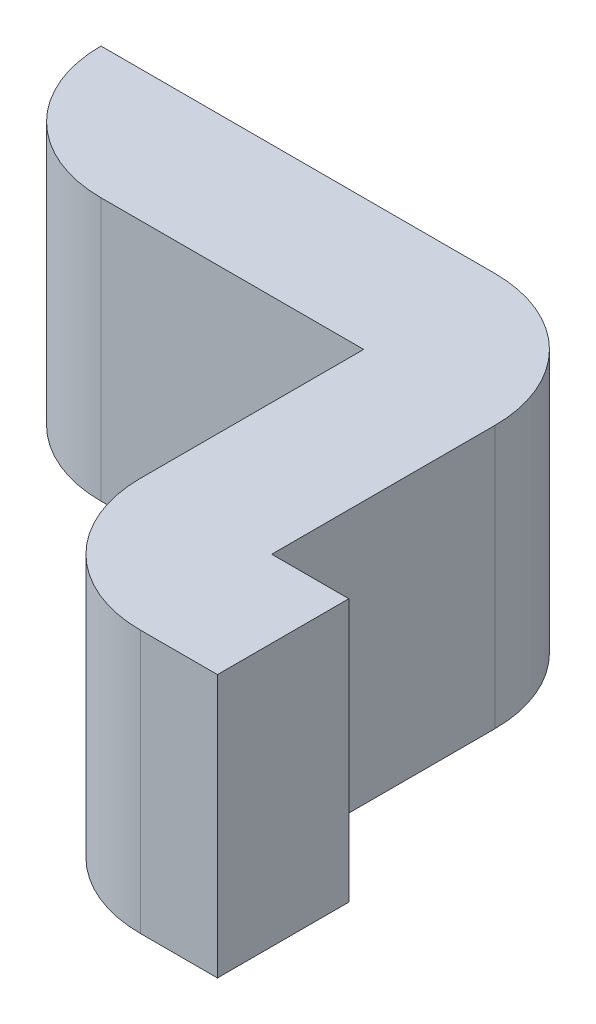
ISO-10303-21;
HEADER;
FILE_DESCRIPTION(('STEP AP214'),'2;1');
FILE_NAME('part.step','',(''),(''),'','','');
FILE_SCHEMA(('AUTOMOTIVE_DESIGN { 1 0 10303 214 1 1 1 1 }'));
ENDSEC;
DATA;
#1=APPLICATION_CONTEXT('core data for automotive mechanical design processes');
#2=APPLICATION_PROTOCOL_DEFINITION('international standard','automotive_design',2000,#1);
#3=PRODUCT_CONTEXT('',#1,'mechanical');
#4=PRODUCT('Part','Part','',(#3));
#5=PRODUCT_RELATED_PRODUCT_CATEGORY('part','',(#4));
#6=PRODUCT_DEFINITION_FORMATION('','',#4);
#7=PRODUCT_DEFINITION_CONTEXT('part definition',#1,'design');
#8=PRODUCT_DEFINITION('design','',#6,#7);
#9=PRODUCT_DEFINITION_SHAPE('','',#8);
#10=(LENGTH_UNIT() NAMED_UNIT(*) SI_UNIT(.MILLI.,.METRE.));
#11=(NAMED_UNIT(*) PLANE_ANGLE_UNIT() SI_UNIT($,.RADIAN.));
#12=(NAMED_UNIT(*) SI_UNIT($,.STERADIAN.) SOLID_ANGLE_UNIT());
#13=UNCERTAINTY_MEASURE_WITH_UNIT(LENGTH_MEASURE(1.E-05),#10,'distance_accuracy_value','');
#14=(GEOMETRIC_REPRESENTATION_CONTEXT(3) GLOBAL_UNCERTAINTY_ASSIGNED_CONTEXT((#13)) GLOBAL_UNIT_ASSIGNED_CONTEXT((#10,
#11,#12)) REPRESENTATION_CONTEXT('',''));
#15=CARTESIAN_POINT('',(0.,0.,0.));
#16=DIRECTION('',(0.,0.,1.));
#17=DIRECTION('',(1.,0.,0.));
#18=AXIS2_PLACEMENT_3D('',#15,#16,#17);
#19=CARTESIAN_POINT('',(-1.0287,1.2954,0.));
#20=DIRECTION('',(0.,-1.,0.));
#21=DIRECTION('',(0.,0.,-1.));
#22=AXIS2_PLACEMENT_3D('',#19,#20,#21);
#23=PLANE('',#22);
#24=DIRECTION('',(-1.,0.,0.));
#25=VECTOR('',#24,1.);
#26=CARTESIAN_POINT('',(-0.9017,1.2954,0.127));
#27=LINE('',#26,#25);
#28=CARTESIAN_POINT('',(-0.9017,1.2954,0.127));
#29=VERTEX_POINT('',#28);
#30=CARTESIAN_POINT('',(-0.6477,1.2954,0.127));
#31=VERTEX_POINT('',#30);
#32=EDGE_CURVE('E102',#29,#31,#27,.F.);
#33=ORIENTED_EDGE('',*,*,#32,.T.);
#34=DIRECTION('',(0.,0.,-1.));
#35=VECTOR('',#34,1.);
#36=CARTESIAN_POINT('',(-0.6477,1.2954,0.127));
#37=LINE('',#36,#35);
#38=CARTESIAN_POINT('',(-0.6477,1.2954,0.3429));
#39=VERTEX_POINT('',#38);
#40=EDGE_CURVE('E105',#31,#39,#37,.F.);
#41=ORIENTED_EDGE('',*,*,#40,.T.);
#42=CARTESIAN_POINT('',(-0.5207,1.2954,0.3429));
#43=DIRECTION('',(0.,-1.,0.));
#44=DIRECTION('',(0.,0.,-1.));
#45=AXIS2_PLACEMENT_3D('',#42,#43,#44);
#46=CIRCLE('',#45,0.127);
#47=CARTESIAN_POINT('',(-0.5207,1.2954,0.4699));
#48=VERTEX_POINT('',#47);
#49=EDGE_CURVE('E117',#48,#39,#46,.T.);
#50=ORIENTED_EDGE('',*,*,#49,.F.);
#51=DIRECTION('',(-1.,0.,0.));
#52=VECTOR('',#51,1.);
#53=CARTESIAN_POINT('',(-0.5207,1.2954,0.4699));
#54=LINE('',#53,#52);
#55=CARTESIAN_POINT('',(-0.4461588971,1.2954,0.4699));
#56=VERTEX_POINT('',#55);
#57=EDGE_CURVE('E134',#48,#56,#54,.F.);
#58=ORIENTED_EDGE('',*,*,#57,.T.);
#59=DIRECTION('',(0.,0.,1.));
#60=VECTOR('',#59,1.);
#61=CARTESIAN_POINT('',(-0.4461588971,1.2954,0.4699));
#62=LINE('',#61,#60);
#63=CARTESIAN_POINT('',(-0.4461588971,1.2954,0.3429));
#64=VERTEX_POINT('',#63);
#65=EDGE_CURVE('E90',#56,#64,#62,.F.);
#66=ORIENTED_EDGE('',*,*,#65,.T.);
#67=DIRECTION('',(1.,0.,0.));
#68=VECTOR('',#67,1.);
#69=CARTESIAN_POINT('',(-0.4461588971,1.2954,0.3429));
#70=LINE('',#69,#68);
#71=CARTESIAN_POINT('',(-0.5207,1.2954,0.3429));
#72=VERTEX_POINT('',#71);
#73=EDGE_CURVE('E87',#64,#72,#70,.F.);
#74=ORIENTED_EDGE('',*,*,#73,.T.);
#75=DIRECTION('',(0.,0.,1.));
#76=VECTOR('',#75,1.);
#77=CARTESIAN_POINT('',(-0.5207,1.2954,0.3429));
#78=LINE('',#77,#76);
#79=CARTESIAN_POINT('',(-0.5207,1.2954,0.127));
#80=VERTEX_POINT('',#79);
#81=EDGE_CURVE('E82',#72,#80,#78,.F.);
#82=ORIENTED_EDGE('',*,*,#81,.T.);
#83=CARTESIAN_POINT('',(-0.6477,1.2954,0.127));
#84=DIRECTION('',(0.,-1.,0.));
#85=DIRECTION('',(0.,0.,-1.));
#86=AXIS2_PLACEMENT_3D('',#83,#84,#85);
#87=CIRCLE('',#86,0.127);
#88=CARTESIAN_POINT('',(-0.6477,1.2954,0.));
#89=VERTEX_POINT('',#88);
#90=EDGE_CURVE('E20',#89,#80,#87,.T.);
#91=ORIENTED_EDGE('',*,*,#90,.F.);
#92=DIRECTION('',(1.,0.,0.));
#93=VECTOR('',#92,1.);
#94=CARTESIAN_POINT('',(-0.6477,1.2954,0.));
#95=LINE('',#94,#93);
#96=CARTESIAN_POINT('',(-1.0287,1.2954,0.));
#97=VERTEX_POINT('',#96);
#98=EDGE_CURVE('E76',#89,#97,#95,.F.);
#99=ORIENTED_EDGE('',*,*,#98,.T.);
#100=CARTESIAN_POINT('',(-0.9017,1.2954,0.));
#101=DIRECTION('',(0.,-1.,0.));
#102=DIRECTION('',(0.,0.,-1.));
#103=AXIS2_PLACEMENT_3D('',#100,#101,#102);
#104=CIRCLE('',#103,0.127);
#105=EDGE_CURVE('E108',#29,#97,#104,.T.);
#106=ORIENTED_EDGE('',*,*,#105,.F.);
#107=EDGE_LOOP('',(#33,#41,#50,#58,#66,#74,#82,#91,#99,#106));
#108=FACE_BOUND('',#107,.T.);
#109=ADVANCED_FACE('F17',(#108),#23,.F.);
#110=CARTESIAN_POINT('',(-0.6477,1.0414,0.));
#111=DIRECTION('',(0.,0.,1.));
#112=DIRECTION('',(1.,0.,0.));
#113=AXIS2_PLACEMENT_3D('',#110,#111,#112);
#114=PLANE('',#113);
#115=DIRECTION('',(0.,-1.,0.));
#116=VECTOR('',#115,1.);
#117=CARTESIAN_POINT('',(-1.0287,1.0414,0.));
#118=LINE('',#117,#116);
#119=CARTESIAN_POINT('',(-1.0287,1.0414,0.));
#120=VERTEX_POINT('',#119);
#121=EDGE_CURVE('E187',#97,#120,#118,.T.);
#122=ORIENTED_EDGE('',*,*,#121,.F.);
#123=ORIENTED_EDGE('',*,*,#98,.F.);
#124=DIRECTION('',(0.,-1.,0.));
#125=VECTOR('',#124,1.);
#126=CARTESIAN_POINT('',(-0.6477,1.0414,0.));
#127=LINE('',#126,#125);
#128=CARTESIAN_POINT('',(-0.6477,1.0414,0.));
#129=VERTEX_POINT('',#128);
#130=EDGE_CURVE('E159',#129,#89,#127,.F.);
#131=ORIENTED_EDGE('',*,*,#130,.F.);
#132=DIRECTION('',(1.,0.,0.));
#133=VECTOR('',#132,1.);
#134=CARTESIAN_POINT('',(-1.0287,1.0414,0.));
#135=LINE('',#134,#133);
#136=EDGE_CURVE('E186',#120,#129,#135,.T.);
#137=ORIENTED_EDGE('',*,*,#136,.F.);
#138=EDGE_LOOP('',(#122,#123,#131,#137));
#139=FACE_BOUND('',#138,.T.);
#140=ADVANCED_FACE('F217',(#139),#114,.F.);
#141=CARTESIAN_POINT('',(-0.6477,1.0414,0.127));
#142=DIRECTION('',(0.,-1.,0.));
#143=DIRECTION('',(0.,0.,-1.));
#144=AXIS2_PLACEMENT_3D('',#141,#142,#143);
#145=CYLINDRICAL_SURFACE('',#144,0.127);
#146=ORIENTED_EDGE('',*,*,#90,.T.);
#147=DIRECTION('',(0.,1.,0.));
#148=VECTOR('',#147,1.);
#149=CARTESIAN_POINT('',(-0.5207,1.0414,0.127));
#150=LINE('',#149,#148);
#151=CARTESIAN_POINT('',(-0.5207,1.0414,0.127));
#152=VERTEX_POINT('',#151);
#153=EDGE_CURVE('E157',#80,#152,#150,.F.);
#154=ORIENTED_EDGE('',*,*,#153,.T.);
#155=CARTESIAN_POINT('',(-0.6477,1.0414,0.127));
#156=DIRECTION('',(0.,-1.,0.));
#157=DIRECTION('',(0.,0.,-1.));
#158=AXIS2_PLACEMENT_3D('',#155,#156,#157);
#159=CIRCLE('',#158,0.127);
#160=EDGE_CURVE('E183',#129,#152,#159,.T.);
#161=ORIENTED_EDGE('',*,*,#160,.F.);
#162=ORIENTED_EDGE('',*,*,#130,.T.);
#163=EDGE_LOOP('',(#146,#154,#161,#162));
#164=FACE_BOUND('',#163,.T.);
#165=ADVANCED_FACE('F214',(#164),#145,.T.);
#166=CARTESIAN_POINT('',(-0.5207,1.0414,0.3429));
#167=DIRECTION('',(-1.,0.,0.));
#168=DIRECTION('',(0.,0.,1.));
#169=AXIS2_PLACEMENT_3D('',#166,#167,#168);
#170=PLANE('',#169);
#171=ORIENTED_EDGE('',*,*,#153,.F.);
#172=ORIENTED_EDGE('',*,*,#81,.F.);
#173=DIRECTION('',(0.,1.,0.));
#174=VECTOR('',#173,1.);
#175=CARTESIAN_POINT('',(-0.5207,1.0414,0.3429));
#176=LINE('',#175,#174);
#177=CARTESIAN_POINT('',(-0.5207,1.0414,0.3429));
#178=VERTEX_POINT('',#177);
#179=EDGE_CURVE('E153',#72,#178,#176,.F.);
#180=ORIENTED_EDGE('',*,*,#179,.T.);
#181=DIRECTION('',(0.,0.,-1.));
#182=VECTOR('',#181,1.);
#183=CARTESIAN_POINT('',(-0.5207,1.0414,0.));
#184=LINE('',#183,#182);
#185=EDGE_CURVE('E150',#152,#178,#184,.F.);
#186=ORIENTED_EDGE('',*,*,#185,.F.);
#187=EDGE_LOOP('',(#171,#172,#180,#186));
#188=FACE_BOUND('',#187,.T.);
#189=ADVANCED_FACE('F211',(#188),#170,.F.);
#190=CARTESIAN_POINT('',(-0.4461588971,1.0414,0.3429));
#191=DIRECTION('',(0.,0.,1.));
#192=DIRECTION('',(1.,0.,0.));
#193=AXIS2_PLACEMENT_3D('',#190,#191,#192);
#194=PLANE('',#193);
#195=ORIENTED_EDGE('',*,*,#179,.F.);
#196=ORIENTED_EDGE('',*,*,#73,.F.);
#197=DIRECTION('',(0.,1.,0.));
#198=VECTOR('',#197,1.);
#199=CARTESIAN_POINT('',(-0.4461588971,1.0414,0.3429));
#200=LINE('',#199,#198);
#201=CARTESIAN_POINT('',(-0.4461588971,1.0414,0.3429));
#202=VERTEX_POINT('',#201);
#203=EDGE_CURVE('E144',#64,#202,#200,.F.);
#204=ORIENTED_EDGE('',*,*,#203,.T.);
#205=DIRECTION('',(1.,0.,0.));
#206=VECTOR('',#205,1.);
#207=CARTESIAN_POINT('',(-1.0287,1.0414,0.3429));
#208=LINE('',#207,#206);
#209=EDGE_CURVE('E141',#178,#202,#208,.T.);
#210=ORIENTED_EDGE('',*,*,#209,.F.);
#211=EDGE_LOOP('',(#195,#196,#204,#210));
#212=FACE_BOUND('',#211,.T.);
#213=ADVANCED_FACE('F208',(#212),#194,.F.);
#214=CARTESIAN_POINT('',(-0.4461588971,1.0414,0.4699));
#215=DIRECTION('',(-1.,0.,0.));
#216=DIRECTION('',(0.,0.,1.));
#217=AXIS2_PLACEMENT_3D('',#214,#215,#216);
#218=PLANE('',#217);
#219=ORIENTED_EDGE('',*,*,#203,.F.);
#220=ORIENTED_EDGE('',*,*,#65,.F.);
#221=DIRECTION('',(0.,1.,0.));
#222=VECTOR('',#221,1.);
#223=CARTESIAN_POINT('',(-0.4461588971,1.0414,0.4699));
#224=LINE('',#223,#222);
#225=CARTESIAN_POINT('',(-0.4461588971,1.0414,0.4699));
#226=VERTEX_POINT('',#225);
#227=EDGE_CURVE('E132',#56,#226,#224,.F.);
#228=ORIENTED_EDGE('',*,*,#227,.T.);
#229=DIRECTION('',(0.,0.,-1.));
#230=VECTOR('',#229,1.);
#231=CARTESIAN_POINT('',(-0.4461588971,1.0414,0.));
#232=LINE('',#231,#230);
#233=EDGE_CURVE('E137',#202,#226,#232,.F.);
#234=ORIENTED_EDGE('',*,*,#233,.F.);
#235=EDGE_LOOP('',(#219,#220,#228,#234));
#236=FACE_BOUND('',#235,.T.);
#237=ADVANCED_FACE('F195',(#236),#218,.F.);
#238=CARTESIAN_POINT('',(-0.5207,1.0414,0.4699));
#239=DIRECTION('',(0.,0.,-1.));
#240=DIRECTION('',(-1.,0.,0.));
#241=AXIS2_PLACEMENT_3D('',#238,#239,#240);
#242=PLANE('',#241);
#243=ORIENTED_EDGE('',*,*,#227,.F.);
#244=ORIENTED_EDGE('',*,*,#57,.F.);
#245=DIRECTION('',(0.,-1.,0.));
#246=VECTOR('',#245,1.);
#247=CARTESIAN_POINT('',(-0.5207,1.0414,0.4699));
#248=LINE('',#247,#246);
#249=CARTESIAN_POINT('',(-0.5207,1.0414,0.4699));
#250=VERTEX_POINT('',#249);
#251=EDGE_CURVE('E129',#250,#48,#248,.F.);
#252=ORIENTED_EDGE('',*,*,#251,.F.);
#253=DIRECTION('',(1.,0.,0.));
#254=VECTOR('',#253,1.);
#255=CARTESIAN_POINT('',(-1.0287,1.0414,0.4699));
#256=LINE('',#255,#254);
#257=EDGE_CURVE('E140',#226,#250,#256,.F.);
#258=ORIENTED_EDGE('',*,*,#257,.F.);
#259=EDGE_LOOP('',(#243,#244,#252,#258));
#260=FACE_BOUND('',#259,.T.);
#261=ADVANCED_FACE('F198',(#260),#242,.F.);
#262=CARTESIAN_POINT('',(-0.5207,1.0414,0.3429));
#263=DIRECTION('',(0.,-1.,0.));
#264=DIRECTION('',(0.,0.,-1.));
#265=AXIS2_PLACEMENT_3D('',#262,#263,#264);
#266=CYLINDRICAL_SURFACE('',#265,0.127);
#267=ORIENTED_EDGE('',*,*,#49,.T.);
#268=DIRECTION('',(0.,1.,0.));
#269=VECTOR('',#268,1.);
#270=CARTESIAN_POINT('',(-0.6477,1.0414,0.3429));
#271=LINE('',#270,#269);
#272=CARTESIAN_POINT('',(-0.6477,1.0414,0.3429));
#273=VERTEX_POINT('',#272);
#274=EDGE_CURVE('E111',#39,#273,#271,.F.);
#275=ORIENTED_EDGE('',*,*,#274,.T.);
#276=CARTESIAN_POINT('',(-0.5207,1.0414,0.3429));
#277=DIRECTION('',(0.,-1.,0.));
#278=DIRECTION('',(0.,0.,-1.));
#279=AXIS2_PLACEMENT_3D('',#276,#277,#278);
#280=CIRCLE('',#279,0.127);
#281=EDGE_CURVE('E179',#250,#273,#280,.T.);
#282=ORIENTED_EDGE('',*,*,#281,.F.);
#283=ORIENTED_EDGE('',*,*,#251,.T.);
#284=EDGE_LOOP('',(#267,#275,#282,#283));
#285=FACE_BOUND('',#284,.T.);
#286=ADVANCED_FACE('F189',(#285),#266,.T.);
#287=CARTESIAN_POINT('',(-0.6477,1.0414,0.127));
#288=DIRECTION('',(1.,0.,0.));
#289=DIRECTION('',(0.,0.,-1.));
#290=AXIS2_PLACEMENT_3D('',#287,#288,#289);
#291=PLANE('',#290);
#292=ORIENTED_EDGE('',*,*,#274,.F.);
#293=ORIENTED_EDGE('',*,*,#40,.F.);
#294=DIRECTION('',(0.,1.,0.));
#295=VECTOR('',#294,1.);
#296=CARTESIAN_POINT('',(-0.6477,1.0414,0.127));
#297=LINE('',#296,#295);
#298=CARTESIAN_POINT('',(-0.6477,1.0414,0.127));
#299=VERTEX_POINT('',#298);
#300=EDGE_CURVE('E110',#31,#299,#297,.F.);
#301=ORIENTED_EDGE('',*,*,#300,.T.);
#302=DIRECTION('',(0.,0.,-1.));
#303=VECTOR('',#302,1.);
#304=CARTESIAN_POINT('',(-0.6477,1.0414,0.));
#305=LINE('',#304,#303);
#306=EDGE_CURVE('E182',#273,#299,#305,.T.);
#307=ORIENTED_EDGE('',*,*,#306,.F.);
#308=EDGE_LOOP('',(#292,#293,#301,#307));
#309=FACE_BOUND('',#308,.T.);
#310=ADVANCED_FACE('F115',(#309),#291,.F.);
#311=CARTESIAN_POINT('',(-0.9017,1.0414,0.127));
#312=DIRECTION('',(0.,0.,-1.));
#313=DIRECTION('',(-1.,0.,0.));
#314=AXIS2_PLACEMENT_3D('',#311,#312,#313);
#315=PLANE('',#314);
#316=ORIENTED_EDGE('',*,*,#300,.F.);
#317=ORIENTED_EDGE('',*,*,#32,.F.);
#318=DIRECTION('',(0.,-1.,0.));
#319=VECTOR('',#318,1.);
#320=CARTESIAN_POINT('',(-0.9017,1.0414,0.127));
#321=LINE('',#320,#319);
#322=CARTESIAN_POINT('',(-0.9017,1.0414,0.127));
#323=VERTEX_POINT('',#322);
#324=EDGE_CURVE('E35',#323,#29,#321,.F.);
#325=ORIENTED_EDGE('',*,*,#324,.F.);
#326=DIRECTION('',(1.,0.,0.));
#327=VECTOR('',#326,1.);
#328=CARTESIAN_POINT('',(-1.0287,1.0414,0.127));
#329=LINE('',#328,#327);
#330=EDGE_CURVE('E26',#299,#323,#329,.F.);
#331=ORIENTED_EDGE('',*,*,#330,.F.);
#332=EDGE_LOOP('',(#316,#317,#325,#331));
#333=FACE_BOUND('',#332,.T.);
#334=ADVANCED_FACE('F119',(#333),#315,.F.);
#335=CARTESIAN_POINT('',(-0.9017,1.0414,0.));
#336=DIRECTION('',(0.,-1.,0.));
#337=DIRECTION('',(0.,0.,-1.));
#338=AXIS2_PLACEMENT_3D('',#335,#336,#337);
#339=CYLINDRICAL_SURFACE('',#338,0.127);
#340=ORIENTED_EDGE('',*,*,#105,.T.);
#341=ORIENTED_EDGE('',*,*,#121,.T.);
#342=CARTESIAN_POINT('',(-0.9017,1.0414,0.));
#343=DIRECTION('',(0.,-1.,0.));
#344=DIRECTION('',(0.,0.,-1.));
#345=AXIS2_PLACEMENT_3D('',#342,#343,#344);
#346=CIRCLE('',#345,0.127);
#347=EDGE_CURVE('E11',#323,#120,#346,.T.);
#348=ORIENTED_EDGE('',*,*,#347,.F.);
#349=ORIENTED_EDGE('',*,*,#324,.T.);
#350=EDGE_LOOP('',(#340,#341,#348,#349));
#351=FACE_BOUND('',#350,.T.);
#352=ADVANCED_FACE('F219',(#351),#339,.T.);
#353=CARTESIAN_POINT('',(-1.0287,1.0414,0.));
#354=DIRECTION('',(0.,-1.,0.));
#355=DIRECTION('',(0.,0.,-1.));
#356=AXIS2_PLACEMENT_3D('',#353,#354,#355);
#357=PLANE('',#356);
#358=ORIENTED_EDGE('',*,*,#330,.T.);
#359=ORIENTED_EDGE('',*,*,#347,.T.);
#360=ORIENTED_EDGE('',*,*,#136,.T.);
#361=ORIENTED_EDGE('',*,*,#160,.T.);
#362=ORIENTED_EDGE('',*,*,#185,.T.);
#363=ORIENTED_EDGE('',*,*,#209,.T.);
#364=ORIENTED_EDGE('',*,*,#233,.T.);
#365=ORIENTED_EDGE('',*,*,#257,.T.);
#366=ORIENTED_EDGE('',*,*,#281,.T.);
#367=ORIENTED_EDGE('',*,*,#306,.T.);
#368=EDGE_LOOP('',(#358,#359,#360,#361,#362,#363,#364,#365,#366,#367));
#369=FACE_BOUND('',#368,.T.);
#370=ADVANCED_FACE('F202',(#369),#357,.T.);
#371=CLOSED_SHELL('',(#109,#140,#165,#189,#213,#237,#261,#286,#310,#334,#352,#370));
#372=MANIFOLD_SOLID_BREP('B1',#371);
#373=ADVANCED_BREP_SHAPE_REPRESENTATION('',(#18,#372),#14);
#374=SHAPE_DEFINITION_REPRESENTATION(#9,#373);
ENDSEC;
END-ISO-10303-21;
